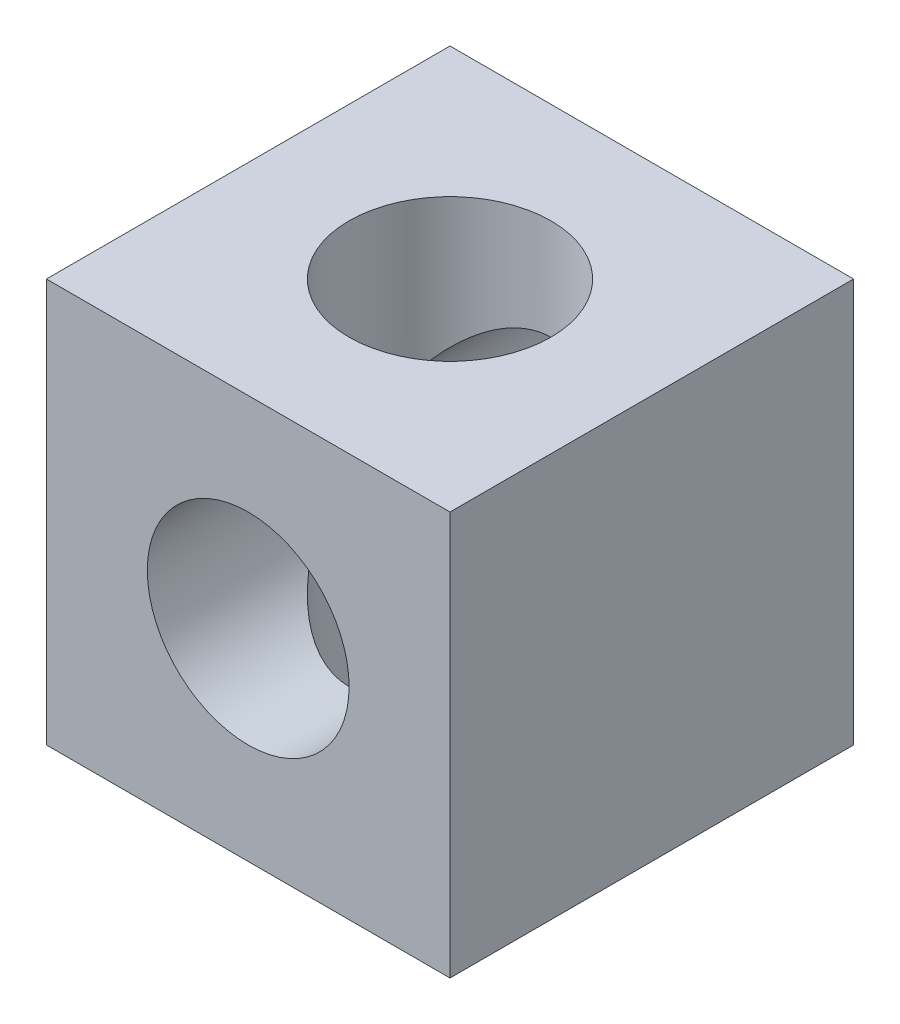
ISO-10303-21;
HEADER;
FILE_DESCRIPTION(('STEP AP214'),'2;1');
FILE_NAME('part.step','',(''),(''),'','','');
FILE_SCHEMA(('AUTOMOTIVE_DESIGN { 1 0 10303 214 1 1 1 1 }'));
ENDSEC;
DATA;
#1=APPLICATION_CONTEXT('core data for automotive mechanical design processes');
#2=APPLICATION_PROTOCOL_DEFINITION('international standard','automotive_design',2000,#1);
#3=PRODUCT_CONTEXT('',#1,'mechanical');
#4=PRODUCT('Part','Part','',(#3));
#5=PRODUCT_RELATED_PRODUCT_CATEGORY('part','',(#4));
#6=PRODUCT_DEFINITION_FORMATION('','',#4);
#7=PRODUCT_DEFINITION_CONTEXT('part definition',#1,'design');
#8=PRODUCT_DEFINITION('design','',#6,#7);
#9=PRODUCT_DEFINITION_SHAPE('','',#8);
#10=(LENGTH_UNIT() NAMED_UNIT(*) SI_UNIT(.MILLI.,.METRE.));
#11=(NAMED_UNIT(*) PLANE_ANGLE_UNIT() SI_UNIT($,.RADIAN.));
#12=(NAMED_UNIT(*) SI_UNIT($,.STERADIAN.) SOLID_ANGLE_UNIT());
#13=UNCERTAINTY_MEASURE_WITH_UNIT(LENGTH_MEASURE(1.E-05),#10,'distance_accuracy_value','');
#14=(GEOMETRIC_REPRESENTATION_CONTEXT(3) GLOBAL_UNCERTAINTY_ASSIGNED_CONTEXT((#13)) GLOBAL_UNIT_ASSIGNED_CONTEXT((#10,
#11,#12)) REPRESENTATION_CONTEXT('',''));
#15=CARTESIAN_POINT('',(0.,0.,0.));
#16=DIRECTION('',(0.,0.,1.));
#17=DIRECTION('',(1.,0.,0.));
#18=AXIS2_PLACEMENT_3D('',#15,#16,#17);
#19=CARTESIAN_POINT('',(-3.1641356201817E-12,0.,10.0000000000068));
#20=DIRECTION('',(0.,0.,-1.00000000000003));
#21=DIRECTION('',(-1.00000000000002,0.,0.));
#22=AXIS2_PLACEMENT_3D('',#19,#20,#21);
#23=CYLINDRICAL_SURFACE('',#22,2.5);
#24=CARTESIAN_POINT('',(-3.38618022510673E-12,8.46545056276682E-13,5.00000000000744));
#25=DIRECTION('',(0.,0.707106781186577,-0.707106781186564));
#26=DIRECTION('',(0.,-0.707106781186577,-0.707106781186575));
#27=AXIS2_PLACEMENT_3D('',#24,#25,#26);
#28=ELLIPSE('',#27,3.53553390593274,2.5);
#29=CARTESIAN_POINT('',(2.499999999997,6.38378239159465E-13,5.00000000000278));
#30=VERTEX_POINT('',#29);
#31=CARTESIAN_POINT('',(-2.50000000000361,8.04911692853238E-13,4.99999999999834));
#32=VERTEX_POINT('',#31);
#33=EDGE_CURVE('E11',#30,#32,#28,.F.);
#34=ORIENTED_EDGE('',*,*,#33,.F.);
#35=CARTESIAN_POINT('',(-3.38618022510673E-12,8.46545056276682E-13,5.00000000000744));
#36=DIRECTION('',(0.,-0.707106781186577,-0.707106781186575));
#37=DIRECTION('',(0.,0.707106781186577,-0.707106781186564));
#38=AXIS2_PLACEMENT_3D('',#35,#36,#37);
#39=ELLIPSE('',#38,3.53553390593274,2.5);
#40=EDGE_CURVE('E30',#32,#30,#39,.F.);
#41=ORIENTED_EDGE('',*,*,#40,.F.);
#42=EDGE_LOOP('',(#34,#41));
#43=FACE_BOUND('',#42,.T.);
#44=CARTESIAN_POINT('',(-3.1641356201817E-12,0.,10.0000000000068));
#45=DIRECTION('',(0.,0.,1.00000000000003));
#46=DIRECTION('',(1.00000000000002,0.,0.));
#47=AXIS2_PLACEMENT_3D('',#44,#45,#46);
#48=CIRCLE('',#47,2.5);
#49=CARTESIAN_POINT('',(2.49999999999688,0.,10.0000000000068));
#50=VERTEX_POINT('',#49);
#51=EDGE_CURVE('E106',#50,#50,#48,.T.);
#52=ORIENTED_EDGE('',*,*,#51,.T.);
#53=EDGE_LOOP('',(#52));
#54=FACE_BOUND('',#53,.T.);
#55=ADVANCED_FACE('F16',(#43,#54),#23,.F.);
#56=CARTESIAN_POINT('',(-5.00000000000172,-4.99999999999937,10.000000000006));
#57=DIRECTION('',(0.,0.,-1.00000000000003));
#58=DIRECTION('',(-1.00000000000002,0.,0.));
#59=AXIS2_PLACEMENT_3D('',#56,#57,#58);
#60=PLANE('',#59);
#61=DIRECTION('',(0.,-1.00000000000002,0.));
#62=VECTOR('',#61,1.);
#63=CARTESIAN_POINT('',(-5.00000000000172,-4.99999999999937,10.000000000006));
#64=LINE('',#63,#62);
#65=CARTESIAN_POINT('',(-5.00000000000428,5.00000000000052,10.0000000000038));
#66=VERTEX_POINT('',#65);
#67=CARTESIAN_POINT('',(-5.00000000000172,-4.99999999999937,10.000000000006));
#68=VERTEX_POINT('',#67);
#69=EDGE_CURVE('E95',#66,#68,#64,.T.);
#70=ORIENTED_EDGE('',*,*,#69,.T.);
#71=DIRECTION('',(1.00000000000002,0.,0.));
#72=VECTOR('',#71,1.);
#73=CARTESIAN_POINT('',(-5.00000000000172,-4.99999999999937,10.000000000006));
#74=LINE('',#73,#72);
#75=CARTESIAN_POINT('',(4.99999999999978,-4.99999999999852,9.99999999999956));
#76=VERTEX_POINT('',#75);
#77=EDGE_CURVE('E93',#68,#76,#74,.T.);
#78=ORIENTED_EDGE('',*,*,#77,.T.);
#79=DIRECTION('',(0.,1.00000000000002,0.));
#80=VECTOR('',#79,1.);
#81=CARTESIAN_POINT('',(4.99999999999978,-4.99999999999852,9.99999999999956));
#82=LINE('',#81,#80);
#83=CARTESIAN_POINT('',(4.99999999999806,5.00000000000093,10.0000000000001));
#84=VERTEX_POINT('',#83);
#85=EDGE_CURVE('E91',#76,#84,#82,.T.);
#86=ORIENTED_EDGE('',*,*,#85,.T.);
#87=DIRECTION('',(-1.00000000000002,0.,0.));
#88=VECTOR('',#87,1.);
#89=CARTESIAN_POINT('',(-5.00000000000428,5.00000000000052,10.0000000000038));
#90=LINE('',#89,#88);
#91=EDGE_CURVE('E38',#84,#66,#90,.T.);
#92=ORIENTED_EDGE('',*,*,#91,.T.);
#93=EDGE_LOOP('',(#70,#78,#86,#92));
#94=FACE_BOUND('',#93,.T.);
#95=ORIENTED_EDGE('',*,*,#51,.F.);
#96=EDGE_LOOP('',(#95));
#97=FACE_BOUND('',#96,.T.);
#98=ADVANCED_FACE('F138',(#94,#97),#60,.F.);
#99=CARTESIAN_POINT('',(-5.00000000000289,-4.99999999999899,-5.55111512312578E-13));
#100=DIRECTION('',(0.,0.,-1.00000000000003));
#101=DIRECTION('',(-1.00000000000002,0.,0.));
#102=AXIS2_PLACEMENT_3D('',#99,#100,#101);
#103=PLANE('',#102);
#104=DIRECTION('',(0.,-1.00000000000002,0.));
#105=VECTOR('',#104,1.);
#106=CARTESIAN_POINT('',(-5.00000000000289,-4.99999999999899,-5.55111512312578E-13));
#107=LINE('',#106,#105);
#108=CARTESIAN_POINT('',(-5.00000000000061,5.000000000001,8.21565038222616E-12));
#109=VERTEX_POINT('',#108);
#110=CARTESIAN_POINT('',(-5.00000000000289,-4.99999999999899,-5.55111512312578E-13));
#111=VERTEX_POINT('',#110);
#112=EDGE_CURVE('E103',#109,#111,#107,.T.);
#113=ORIENTED_EDGE('',*,*,#112,.F.);
#114=DIRECTION('',(-1.00000000000002,0.,0.));
#115=VECTOR('',#114,1.);
#116=CARTESIAN_POINT('',(-5.00000000000061,5.000000000001,8.21565038222616E-12));
#117=LINE('',#116,#115);
#118=CARTESIAN_POINT('',(4.99999999999851,5.00000000000021,-6.66133814775094E-13));
#119=VERTEX_POINT('',#118);
#120=EDGE_CURVE('E97',#119,#109,#117,.T.);
#121=ORIENTED_EDGE('',*,*,#120,.F.);
#122=DIRECTION('',(0.,1.00000000000002,0.));
#123=VECTOR('',#122,1.);
#124=CARTESIAN_POINT('',(4.99999999999889,-4.99999999999956,7.43849426498855E-12));
#125=LINE('',#124,#123);
#126=CARTESIAN_POINT('',(4.99999999999889,-4.99999999999956,7.43849426498855E-12));
#127=VERTEX_POINT('',#126);
#128=EDGE_CURVE('E99',#127,#119,#125,.T.);
#129=ORIENTED_EDGE('',*,*,#128,.F.);
#130=DIRECTION('',(1.00000000000002,0.,0.));
#131=VECTOR('',#130,1.);
#132=CARTESIAN_POINT('',(-5.00000000000289,-4.99999999999899,-5.55111512312578E-13));
#133=LINE('',#132,#131);
#134=EDGE_CURVE('E101',#111,#127,#133,.T.);
#135=ORIENTED_EDGE('',*,*,#134,.F.);
#136=EDGE_LOOP('',(#113,#121,#129,#135));
#137=FACE_BOUND('',#136,.T.);
#138=CARTESIAN_POINT('',(-5.55111512312578E-13,1.66533453693773E-13,-6.66133814775094E-12));
#139=DIRECTION('',(0.,0.,1.00000000000003));
#140=DIRECTION('',(1.00000000000002,0.,0.));
#141=AXIS2_PLACEMENT_3D('',#138,#139,#140);
#142=CIRCLE('',#141,2.5);
#143=CARTESIAN_POINT('',(2.49999999999948,1.40393339315148E-13,-6.67021993194794E-12));
#144=VERTEX_POINT('',#143);
#145=EDGE_CURVE('E109',#144,#144,#142,.T.);
#146=ORIENTED_EDGE('',*,*,#145,.T.);
#147=EDGE_LOOP('',(#146));
#148=FACE_BOUND('',#147,.T.);
#149=ADVANCED_FACE('F132',(#137,#148),#103,.T.);
#150=CARTESIAN_POINT('',(-5.00000000000172,-4.99999999999937,10.000000000006));
#151=DIRECTION('',(1.00000000000002,0.,0.));
#152=DIRECTION('',(0.,0.,-1.00000000000003));
#153=AXIS2_PLACEMENT_3D('',#150,#151,#152);
#154=PLANE('',#153);
#155=ORIENTED_EDGE('',*,*,#112,.T.);
#156=DIRECTION('',(0.,0.,-1.00000000000003));
#157=VECTOR('',#156,1.);
#158=CARTESIAN_POINT('',(-5.00000000000172,-4.99999999999937,10.000000000006));
#159=LINE('',#158,#157);
#160=EDGE_CURVE('E73',#68,#111,#159,.T.);
#161=ORIENTED_EDGE('',*,*,#160,.F.);
#162=ORIENTED_EDGE('',*,*,#69,.F.);
#163=DIRECTION('',(0.,0.,-1.00000000000003));
#164=VECTOR('',#163,1.);
#165=CARTESIAN_POINT('',(-5.00000000000428,5.00000000000052,10.0000000000038));
#166=LINE('',#165,#164);
#167=EDGE_CURVE('E87',#66,#109,#166,.T.);
#168=ORIENTED_EDGE('',*,*,#167,.T.);
#169=EDGE_LOOP('',(#155,#161,#162,#168));
#170=FACE_BOUND('',#169,.T.);
#171=ADVANCED_FACE('F18',(#170),#154,.F.);
#172=CARTESIAN_POINT('',(-5.00000000000172,-4.99999999999937,10.000000000006));
#173=DIRECTION('',(0.,1.00000000000002,0.));
#174=DIRECTION('',(0.,0.,1.00000000000003));
#175=AXIS2_PLACEMENT_3D('',#172,#173,#174);
#176=PLANE('',#175);
#177=CARTESIAN_POINT('',(-2.16493489801906E-12,-4.99999999999966,5.00000000000766));
#178=DIRECTION('',(0.,1.00000000000002,0.));
#179=DIRECTION('',(0.,0.,1.00000000000003));
#180=AXIS2_PLACEMENT_3D('',#177,#178,#179);
#181=CIRCLE('',#180,2.5);
#182=CARTESIAN_POINT('',(-2.1747881273626E-12,-4.99999999999964,7.50000000000773));
#183=VERTEX_POINT('',#182);
#184=EDGE_CURVE('E112',#183,#183,#181,.T.);
#185=ORIENTED_EDGE('',*,*,#184,.T.);
#186=EDGE_LOOP('',(#185));
#187=FACE_BOUND('',#186,.T.);
#188=ORIENTED_EDGE('',*,*,#134,.T.);
#189=DIRECTION('',(0.,0.,-1.00000000000003));
#190=VECTOR('',#189,1.);
#191=CARTESIAN_POINT('',(4.99999999999978,-4.99999999999852,9.99999999999956));
#192=LINE('',#191,#190);
#193=EDGE_CURVE('E81',#76,#127,#192,.T.);
#194=ORIENTED_EDGE('',*,*,#193,.F.);
#195=ORIENTED_EDGE('',*,*,#77,.F.);
#196=ORIENTED_EDGE('',*,*,#160,.T.);
#197=EDGE_LOOP('',(#188,#194,#195,#196));
#198=FACE_BOUND('',#197,.T.);
#199=ADVANCED_FACE('F136',(#187,#198),#176,.F.);
#200=CARTESIAN_POINT('',(4.99999999999978,-4.99999999999852,9.99999999999956));
#201=DIRECTION('',(-1.00000000000002,0.,0.));
#202=DIRECTION('',(0.,0.,1.00000000000003));
#203=AXIS2_PLACEMENT_3D('',#200,#201,#202);
#204=PLANE('',#203);
#205=ORIENTED_EDGE('',*,*,#128,.T.);
#206=DIRECTION('',(0.,0.,-1.00000000000003));
#207=VECTOR('',#206,1.);
#208=CARTESIAN_POINT('',(4.99999999999806,5.00000000000093,10.0000000000001));
#209=LINE('',#208,#207);
#210=EDGE_CURVE('E84',#84,#119,#209,.T.);
#211=ORIENTED_EDGE('',*,*,#210,.F.);
#212=ORIENTED_EDGE('',*,*,#85,.F.);
#213=ORIENTED_EDGE('',*,*,#193,.T.);
#214=EDGE_LOOP('',(#205,#211,#212,#213));
#215=FACE_BOUND('',#214,.T.);
#216=ADVANCED_FACE('F122',(#215),#204,.F.);
#217=CARTESIAN_POINT('',(-5.00000000000428,5.00000000000052,10.0000000000038));
#218=DIRECTION('',(0.,-1.00000000000002,0.));
#219=DIRECTION('',(1.00000000000002,0.,0.));
#220=AXIS2_PLACEMENT_3D('',#217,#218,#219);
#221=PLANE('',#220);
#222=CARTESIAN_POINT('',(-1.38777878078145E-12,5.00000000000028,5.00000000000778));
#223=DIRECTION('',(0.,1.00000000000002,0.));
#224=DIRECTION('',(0.,0.,1.00000000000003));
#225=AXIS2_PLACEMENT_3D('',#222,#223,#224);
#226=CIRCLE('',#225,2.5);
#227=CARTESIAN_POINT('',(-1.39763201012499E-12,5.0000000000003,7.50000000000784));
#228=VERTEX_POINT('',#227);
#229=EDGE_CURVE('E115',#228,#228,#226,.T.);
#230=ORIENTED_EDGE('',*,*,#229,.F.);
#231=EDGE_LOOP('',(#230));
#232=FACE_BOUND('',#231,.T.);
#233=ORIENTED_EDGE('',*,*,#120,.T.);
#234=ORIENTED_EDGE('',*,*,#167,.F.);
#235=ORIENTED_EDGE('',*,*,#91,.F.);
#236=ORIENTED_EDGE('',*,*,#210,.T.);
#237=EDGE_LOOP('',(#233,#234,#235,#236));
#238=FACE_BOUND('',#237,.T.);
#239=ADVANCED_FACE('F119',(#232,#238),#221,.F.);
#240=CARTESIAN_POINT('',(-3.38618022510673E-12,8.46545056276682E-13,5.00000000000744));
#241=DIRECTION('',(0.,0.707106781186577,-0.707106781186564));
#242=DIRECTION('',(0.,-0.707106781186577,-0.707106781186575));
#243=AXIS2_PLACEMENT_3D('',#240,#241,#242);
#244=ELLIPSE('',#243,3.53553390593274,2.5);
#245=EDGE_CURVE('E24',#30,#32,#244,.T.);
#246=ORIENTED_EDGE('',*,*,#245,.F.);
#247=CARTESIAN_POINT('',(-3.38618022510673E-12,8.46545056276682E-13,5.00000000000744));
#248=DIRECTION('',(0.,-0.707106781186577,-0.707106781186575));
#249=DIRECTION('',(0.,0.707106781186577,-0.707106781186564));
#250=AXIS2_PLACEMENT_3D('',#247,#248,#249);
#251=ELLIPSE('',#250,3.53553390593274,2.5);
#252=EDGE_CURVE('E64',#32,#30,#251,.T.);
#253=ORIENTED_EDGE('',*,*,#252,.F.);
#254=EDGE_LOOP('',(#246,#253));
#255=FACE_BOUND('',#254,.T.);
#256=ORIENTED_EDGE('',*,*,#145,.F.);
#257=EDGE_LOOP('',(#256));
#258=FACE_BOUND('',#257,.T.);
#259=ADVANCED_FACE('F76',(#255,#258),#23,.F.);
#260=CARTESIAN_POINT('',(-2.16493489801906E-12,-4.99999999999966,5.00000000000766));
#261=DIRECTION('',(0.,1.00000000000002,0.));
#262=DIRECTION('',(0.,0.,1.00000000000003));
#263=AXIS2_PLACEMENT_3D('',#260,#261,#262);
#264=CYLINDRICAL_SURFACE('',#263,2.5);
#265=ORIENTED_EDGE('',*,*,#245,.T.);
#266=ORIENTED_EDGE('',*,*,#40,.T.);
#267=EDGE_LOOP('',(#265,#266));
#268=FACE_BOUND('',#267,.T.);
#269=ORIENTED_EDGE('',*,*,#184,.F.);
#270=EDGE_LOOP('',(#269));
#271=FACE_BOUND('',#270,.T.);
#272=ADVANCED_FACE('F71',(#268,#271),#264,.F.);
#273=ORIENTED_EDGE('',*,*,#33,.T.);
#274=ORIENTED_EDGE('',*,*,#252,.T.);
#275=EDGE_LOOP('',(#273,#274));
#276=FACE_BOUND('',#275,.T.);
#277=ORIENTED_EDGE('',*,*,#229,.T.);
#278=EDGE_LOOP('',(#277));
#279=FACE_BOUND('',#278,.T.);
#280=ADVANCED_FACE('F65',(#276,#279),#264,.F.);
#281=CLOSED_SHELL('',(#55,#98,#149,#171,#199,#216,#239,#259,#272,#280));
#282=MANIFOLD_SOLID_BREP('B1',#281);
#283=ADVANCED_BREP_SHAPE_REPRESENTATION('',(#18,#282),#14);
#284=SHAPE_DEFINITION_REPRESENTATION(#9,#283);
ENDSEC;
END-ISO-10303-21;
